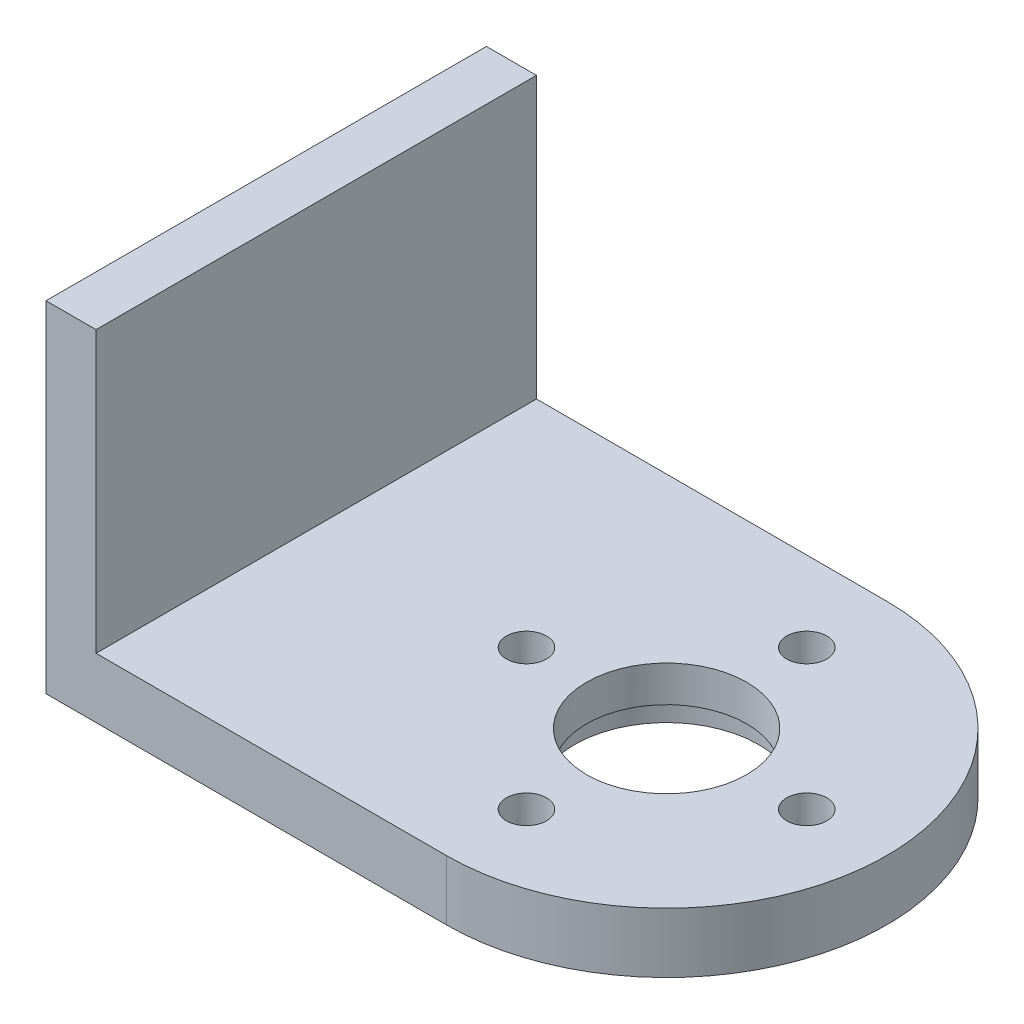
ISO-10303-21;
HEADER;
FILE_DESCRIPTION(('STEP AP214'),'2;1');
FILE_NAME('part.step','',(''),(''),'','','');
FILE_SCHEMA(('AUTOMOTIVE_DESIGN { 1 0 10303 214 1 1 1 1 }'));
ENDSEC;
DATA;
#1=APPLICATION_CONTEXT('core data for automotive mechanical design processes');
#2=APPLICATION_PROTOCOL_DEFINITION('international standard','automotive_design',2000,#1);
#3=PRODUCT_CONTEXT('',#1,'mechanical');
#4=PRODUCT('Part','Part','',(#3));
#5=PRODUCT_RELATED_PRODUCT_CATEGORY('part','',(#4));
#6=PRODUCT_DEFINITION_FORMATION('','',#4);
#7=PRODUCT_DEFINITION_CONTEXT('part definition',#1,'design');
#8=PRODUCT_DEFINITION('design','',#6,#7);
#9=PRODUCT_DEFINITION_SHAPE('','',#8);
#10=(LENGTH_UNIT() NAMED_UNIT(*) SI_UNIT(.MILLI.,.METRE.));
#11=(NAMED_UNIT(*) PLANE_ANGLE_UNIT() SI_UNIT($,.RADIAN.));
#12=(NAMED_UNIT(*) SI_UNIT($,.STERADIAN.) SOLID_ANGLE_UNIT());
#13=UNCERTAINTY_MEASURE_WITH_UNIT(LENGTH_MEASURE(1.E-05),#10,'distance_accuracy_value','');
#14=(GEOMETRIC_REPRESENTATION_CONTEXT(3) GLOBAL_UNCERTAINTY_ASSIGNED_CONTEXT((#13)) GLOBAL_UNIT_ASSIGNED_CONTEXT((#10,
#11,#12)) REPRESENTATION_CONTEXT('',''));
#15=CARTESIAN_POINT('',(0.,0.,0.));
#16=DIRECTION('',(0.,0.,1.));
#17=DIRECTION('',(1.,0.,0.));
#18=AXIS2_PLACEMENT_3D('',#15,#16,#17);
#19=CARTESIAN_POINT('',(5.99999999999998,3.,7.));
#20=DIRECTION('',(0.,-1.,0.));
#21=DIRECTION('',(0.,0.,-1.));
#22=AXIS2_PLACEMENT_3D('',#19,#20,#21);
#23=CYLINDRICAL_SURFACE('',#22,1.);
#24=CARTESIAN_POINT('',(5.99999999999998,3.,7.));
#25=DIRECTION('',(0.,1.,0.));
#26=DIRECTION('',(0.,0.,1.));
#27=AXIS2_PLACEMENT_3D('',#24,#25,#26);
#28=CIRCLE('',#27,1.);
#29=CARTESIAN_POINT('',(5.99999999999998,3.,8.));
#30=VERTEX_POINT('',#29);
#31=EDGE_CURVE('E175',#30,#30,#28,.T.);
#32=ORIENTED_EDGE('',*,*,#31,.T.);
#33=EDGE_LOOP('',(#32));
#34=FACE_BOUND('',#33,.T.);
#35=CARTESIAN_POINT('',(5.99999999999998,1.5,7.));
#36=DIRECTION('',(0.,-1.,0.));
#37=DIRECTION('',(0.,0.,-1.));
#38=AXIS2_PLACEMENT_3D('',#35,#36,#37);
#39=CIRCLE('',#38,1.);
#40=CARTESIAN_POINT('',(5.99999999999998,1.5,6.));
#41=VERTEX_POINT('',#40);
#42=EDGE_CURVE('E42',#41,#41,#39,.T.);
#43=ORIENTED_EDGE('',*,*,#42,.T.);
#44=EDGE_LOOP('',(#43));
#45=FACE_BOUND('',#44,.T.);
#46=ADVANCED_FACE('F38',(#34,#45),#23,.F.);
#47=CARTESIAN_POINT('',(-1.,3.,0.));
#48=DIRECTION('',(0.,-1.,0.));
#49=DIRECTION('',(0.,0.,-1.));
#50=AXIS2_PLACEMENT_3D('',#47,#48,#49);
#51=CYLINDRICAL_SURFACE('',#50,1.);
#52=CARTESIAN_POINT('',(-1.,3.,0.));
#53=DIRECTION('',(0.,1.,0.));
#54=DIRECTION('',(0.,0.,1.));
#55=AXIS2_PLACEMENT_3D('',#52,#53,#54);
#56=CIRCLE('',#55,1.);
#57=CARTESIAN_POINT('',(-1.,3.,0.999999999999951));
#58=VERTEX_POINT('',#57);
#59=EDGE_CURVE('E172',#58,#58,#56,.T.);
#60=ORIENTED_EDGE('',*,*,#59,.T.);
#61=EDGE_LOOP('',(#60));
#62=FACE_BOUND('',#61,.T.);
#63=CARTESIAN_POINT('',(-1.,1.5,0.));
#64=DIRECTION('',(0.,-1.,0.));
#65=DIRECTION('',(0.,0.,-1.));
#66=AXIS2_PLACEMENT_3D('',#63,#64,#65);
#67=CIRCLE('',#66,1.);
#68=CARTESIAN_POINT('',(-1.,1.5,-1.00000000000005));
#69=VERTEX_POINT('',#68);
#70=EDGE_CURVE('E132',#69,#69,#67,.T.);
#71=ORIENTED_EDGE('',*,*,#70,.T.);
#72=EDGE_LOOP('',(#71));
#73=FACE_BOUND('',#72,.T.);
#74=ADVANCED_FACE('F208',(#62,#73),#51,.F.);
#75=CARTESIAN_POINT('',(6.00000000000008,3.,-7.));
#76=DIRECTION('',(0.,-1.,0.));
#77=DIRECTION('',(0.,0.,-1.));
#78=AXIS2_PLACEMENT_3D('',#75,#76,#77);
#79=CYLINDRICAL_SURFACE('',#78,1.);
#80=CARTESIAN_POINT('',(6.00000000000008,3.,-7.));
#81=DIRECTION('',(0.,1.,0.));
#82=DIRECTION('',(0.,0.,1.));
#83=AXIS2_PLACEMENT_3D('',#80,#81,#82);
#84=CIRCLE('',#83,1.);
#85=CARTESIAN_POINT('',(6.00000000000008,3.,-6.));
#86=VERTEX_POINT('',#85);
#87=EDGE_CURVE('E169',#86,#86,#84,.T.);
#88=ORIENTED_EDGE('',*,*,#87,.T.);
#89=EDGE_LOOP('',(#88));
#90=FACE_BOUND('',#89,.T.);
#91=CARTESIAN_POINT('',(6.00000000000008,1.5,-7.));
#92=DIRECTION('',(0.,-1.,0.));
#93=DIRECTION('',(0.,0.,-1.));
#94=AXIS2_PLACEMENT_3D('',#91,#92,#93);
#95=CIRCLE('',#94,1.);
#96=CARTESIAN_POINT('',(6.00000000000008,1.5,-8.));
#97=VERTEX_POINT('',#96);
#98=EDGE_CURVE('E130',#97,#97,#95,.T.);
#99=ORIENTED_EDGE('',*,*,#98,.T.);
#100=EDGE_LOOP('',(#99));
#101=FACE_BOUND('',#100,.T.);
#102=ADVANCED_FACE('F214',(#90,#101),#79,.F.);
#103=CARTESIAN_POINT('',(13.,3.,0.));
#104=DIRECTION('',(0.,-1.,0.));
#105=DIRECTION('',(0.,0.,-1.));
#106=AXIS2_PLACEMENT_3D('',#103,#104,#105);
#107=CYLINDRICAL_SURFACE('',#106,1.);
#108=CARTESIAN_POINT('',(13.,3.,0.));
#109=DIRECTION('',(0.,1.,0.));
#110=DIRECTION('',(0.,0.,1.));
#111=AXIS2_PLACEMENT_3D('',#108,#109,#110);
#112=CIRCLE('',#111,1.);
#113=CARTESIAN_POINT('',(13.,3.,1.));
#114=VERTEX_POINT('',#113);
#115=EDGE_CURVE('E108',#114,#114,#112,.T.);
#116=ORIENTED_EDGE('',*,*,#115,.T.);
#117=EDGE_LOOP('',(#116));
#118=FACE_BOUND('',#117,.T.);
#119=CARTESIAN_POINT('',(13.,1.5,0.));
#120=DIRECTION('',(0.,-1.,0.));
#121=DIRECTION('',(0.,0.,-1.));
#122=AXIS2_PLACEMENT_3D('',#119,#120,#121);
#123=CIRCLE('',#122,1.);
#124=CARTESIAN_POINT('',(13.,1.5,-1.));
#125=VERTEX_POINT('',#124);
#126=EDGE_CURVE('E125',#125,#125,#123,.T.);
#127=ORIENTED_EDGE('',*,*,#126,.T.);
#128=EDGE_LOOP('',(#127));
#129=FACE_BOUND('',#128,.T.);
#130=ADVANCED_FACE('F222',(#118,#129),#107,.F.);
#131=CARTESIAN_POINT('',(6.,3.,0.));
#132=DIRECTION('',(0.,-1.,0.));
#133=DIRECTION('',(0.,0.,-1.));
#134=AXIS2_PLACEMENT_3D('',#131,#132,#133);
#135=CYLINDRICAL_SURFACE('',#134,4.);
#136=CARTESIAN_POINT('',(6.,3.,0.));
#137=DIRECTION('',(0.,1.,0.));
#138=DIRECTION('',(0.,0.,1.));
#139=AXIS2_PLACEMENT_3D('',#136,#137,#138);
#140=CIRCLE('',#139,4.);
#141=CARTESIAN_POINT('',(6.,3.,4.));
#142=VERTEX_POINT('',#141);
#143=EDGE_CURVE('E112',#142,#142,#140,.T.);
#144=ORIENTED_EDGE('',*,*,#143,.T.);
#145=EDGE_LOOP('',(#144));
#146=FACE_BOUND('',#145,.T.);
#147=CARTESIAN_POINT('',(6.,1.2,0.));
#148=DIRECTION('',(0.,-1.,0.));
#149=DIRECTION('',(0.,0.,-1.));
#150=AXIS2_PLACEMENT_3D('',#147,#148,#149);
#151=CIRCLE('',#150,4.);
#152=CARTESIAN_POINT('',(6.,1.2,-4.));
#153=VERTEX_POINT('',#152);
#154=EDGE_CURVE('E121',#153,#153,#151,.T.);
#155=ORIENTED_EDGE('',*,*,#154,.T.);
#156=EDGE_LOOP('',(#155));
#157=FACE_BOUND('',#156,.T.);
#158=ADVANCED_FACE('F219',(#146,#157),#135,.F.);
#159=CARTESIAN_POINT('',(6.,3.,0.));
#160=DIRECTION('',(0.,1.,0.));
#161=DIRECTION('',(0.,0.,1.));
#162=AXIS2_PLACEMENT_3D('',#159,#160,#161);
#163=PLANE('',#162);
#164=DIRECTION('',(0.,0.,-1.));
#165=VECTOR('',#164,1.);
#166=CARTESIAN_POINT('',(-11.5,3.,-11.));
#167=LINE('',#166,#165);
#168=CARTESIAN_POINT('',(-11.5,3.,11.));
#169=VERTEX_POINT('',#168);
#170=CARTESIAN_POINT('',(-11.5,3.,-11.));
#171=VERTEX_POINT('',#170);
#172=EDGE_CURVE('E55',#169,#171,#167,.T.);
#173=ORIENTED_EDGE('',*,*,#172,.F.);
#174=DIRECTION('',(1.,0.,0.));
#175=VECTOR('',#174,1.);
#176=CARTESIAN_POINT('',(6.,3.,11.));
#177=LINE('',#176,#175);
#178=CARTESIAN_POINT('',(6.,3.,11.));
#179=VERTEX_POINT('',#178);
#180=EDGE_CURVE('E93',#169,#179,#177,.T.);
#181=ORIENTED_EDGE('',*,*,#180,.T.);
#182=CARTESIAN_POINT('',(6.,3.,0.));
#183=DIRECTION('',(0.,1.,0.));
#184=DIRECTION('',(0.,0.,1.));
#185=AXIS2_PLACEMENT_3D('',#182,#183,#184);
#186=CIRCLE('',#185,11.);
#187=CARTESIAN_POINT('',(6.,3.,-11.));
#188=VERTEX_POINT('',#187);
#189=EDGE_CURVE('E61',#179,#188,#186,.T.);
#190=ORIENTED_EDGE('',*,*,#189,.T.);
#191=DIRECTION('',(-1.,0.,0.));
#192=VECTOR('',#191,1.);
#193=CARTESIAN_POINT('',(-14.,3.,-11.));
#194=LINE('',#193,#192);
#195=EDGE_CURVE('E104',#188,#171,#194,.T.);
#196=ORIENTED_EDGE('',*,*,#195,.T.);
#197=EDGE_LOOP('',(#173,#181,#190,#196));
#198=FACE_BOUND('',#197,.T.);
#199=ORIENTED_EDGE('',*,*,#59,.F.);
#200=EDGE_LOOP('',(#199));
#201=FACE_BOUND('',#200,.T.);
#202=ORIENTED_EDGE('',*,*,#143,.F.);
#203=EDGE_LOOP('',(#202));
#204=FACE_BOUND('',#203,.T.);
#205=ORIENTED_EDGE('',*,*,#115,.F.);
#206=EDGE_LOOP('',(#205));
#207=FACE_BOUND('',#206,.T.);
#208=ORIENTED_EDGE('',*,*,#31,.F.);
#209=EDGE_LOOP('',(#208));
#210=FACE_BOUND('',#209,.T.);
#211=ORIENTED_EDGE('',*,*,#87,.F.);
#212=EDGE_LOOP('',(#211));
#213=FACE_BOUND('',#212,.T.);
#214=ADVANCED_FACE('F182',(#198,#201,#204,#207,#210,#213),#163,.T.);
#215=CARTESIAN_POINT('',(6.,0.,0.));
#216=DIRECTION('',(0.,1.,0.));
#217=DIRECTION('',(0.,0.,1.));
#218=AXIS2_PLACEMENT_3D('',#215,#216,#217);
#219=PLANE('',#218);
#220=CARTESIAN_POINT('',(5.99999999999415,0.,-6.99999999999538));
#221=DIRECTION('',(0.,-1.,0.));
#222=DIRECTION('',(0.,0.,-1.));
#223=AXIS2_PLACEMENT_3D('',#220,#221,#222);
#224=CIRCLE('',#223,1.9);
#225=CARTESIAN_POINT('',(5.99999999999415,0.,-8.89999999999538));
#226=VERTEX_POINT('',#225);
#227=EDGE_CURVE('E260',#226,#226,#224,.T.);
#228=ORIENTED_EDGE('',*,*,#227,.F.);
#229=EDGE_LOOP('',(#228));
#230=FACE_BOUND('',#229,.T.);
#231=CARTESIAN_POINT('',(-1.00000000000121,0.,1.04930458969917E-11));
#232=DIRECTION('',(0.,-1.,0.));
#233=DIRECTION('',(0.,0.,-1.));
#234=AXIS2_PLACEMENT_3D('',#231,#232,#233);
#235=CIRCLE('',#234,1.9);
#236=CARTESIAN_POINT('',(-1.00000000000121,0.,-1.89999999998951));
#237=VERTEX_POINT('',#236);
#238=EDGE_CURVE('E268',#237,#237,#235,.T.);
#239=ORIENTED_EDGE('',*,*,#238,.F.);
#240=EDGE_LOOP('',(#239));
#241=FACE_BOUND('',#240,.T.);
#242=CARTESIAN_POINT('',(6.00000000000469,0.,7.00000000000583));
#243=DIRECTION('',(0.,-1.,0.));
#244=DIRECTION('',(0.,0.,-1.));
#245=AXIS2_PLACEMENT_3D('',#242,#243,#244);
#246=CIRCLE('',#245,1.9);
#247=CARTESIAN_POINT('',(6.00000000000469,0.,5.10000000000583));
#248=VERTEX_POINT('',#247);
#249=EDGE_CURVE('E273',#248,#248,#246,.T.);
#250=ORIENTED_EDGE('',*,*,#249,.F.);
#251=EDGE_LOOP('',(#250));
#252=FACE_BOUND('',#251,.T.);
#253=CARTESIAN_POINT('',(13.,0.,0.));
#254=DIRECTION('',(0.,-1.,0.));
#255=DIRECTION('',(0.,0.,-1.));
#256=AXIS2_PLACEMENT_3D('',#253,#254,#255);
#257=CIRCLE('',#256,1.9);
#258=CARTESIAN_POINT('',(13.,0.,-1.9));
#259=VERTEX_POINT('',#258);
#260=EDGE_CURVE('E138',#259,#259,#257,.T.);
#261=ORIENTED_EDGE('',*,*,#260,.F.);
#262=EDGE_LOOP('',(#261));
#263=FACE_BOUND('',#262,.T.);
#264=CARTESIAN_POINT('',(5.99999999999939,0.,5.22208257912396E-12));
#265=DIRECTION('',(0.,-1.,0.));
#266=DIRECTION('',(0.,0.,-1.));
#267=AXIS2_PLACEMENT_3D('',#264,#265,#266);
#268=CIRCLE('',#267,4.60000000001315);
#269=CARTESIAN_POINT('',(5.99999999999939,0.,-4.60000000000793));
#270=VERTEX_POINT('',#269);
#271=EDGE_CURVE('E128',#270,#270,#268,.T.);
#272=ORIENTED_EDGE('',*,*,#271,.F.);
#273=EDGE_LOOP('',(#272));
#274=FACE_BOUND('',#273,.T.);
#275=DIRECTION('',(1.,0.,0.));
#276=VECTOR('',#275,1.);
#277=CARTESIAN_POINT('',(6.,0.,11.));
#278=LINE('',#277,#276);
#279=CARTESIAN_POINT('',(-14.,0.,11.));
#280=VERTEX_POINT('',#279);
#281=CARTESIAN_POINT('',(6.,0.,11.));
#282=VERTEX_POINT('',#281);
#283=EDGE_CURVE('E99',#280,#282,#278,.T.);
#284=ORIENTED_EDGE('',*,*,#283,.F.);
#285=DIRECTION('',(0.,0.,1.));
#286=VECTOR('',#285,1.);
#287=CARTESIAN_POINT('',(-14.,0.,11.));
#288=LINE('',#287,#286);
#289=CARTESIAN_POINT('',(-14.,0.,-11.));
#290=VERTEX_POINT('',#289);
#291=EDGE_CURVE('E81',#290,#280,#288,.T.);
#292=ORIENTED_EDGE('',*,*,#291,.F.);
#293=DIRECTION('',(-1.,0.,0.));
#294=VECTOR('',#293,1.);
#295=CARTESIAN_POINT('',(-14.,0.,-11.));
#296=LINE('',#295,#294);
#297=CARTESIAN_POINT('',(6.,0.,-11.));
#298=VERTEX_POINT('',#297);
#299=EDGE_CURVE('E94',#298,#290,#296,.T.);
#300=ORIENTED_EDGE('',*,*,#299,.F.);
#301=CARTESIAN_POINT('',(6.,0.,0.));
#302=DIRECTION('',(0.,1.,0.));
#303=DIRECTION('',(0.,0.,1.));
#304=AXIS2_PLACEMENT_3D('',#301,#302,#303);
#305=CIRCLE('',#304,11.);
#306=EDGE_CURVE('E107',#282,#298,#305,.T.);
#307=ORIENTED_EDGE('',*,*,#306,.F.);
#308=EDGE_LOOP('',(#284,#292,#300,#307));
#309=FACE_BOUND('',#308,.T.);
#310=ADVANCED_FACE('F106',(#230,#241,#252,#263,#274,#309),#219,.F.);
#311=CARTESIAN_POINT('',(6.,3.,11.));
#312=DIRECTION('',(0.,0.,-1.));
#313=DIRECTION('',(-1.,0.,0.));
#314=AXIS2_PLACEMENT_3D('',#311,#312,#313);
#315=PLANE('',#314);
#316=ORIENTED_EDGE('',*,*,#283,.T.);
#317=DIRECTION('',(0.,-1.,0.));
#318=VECTOR('',#317,1.);
#319=CARTESIAN_POINT('',(6.,3.,11.));
#320=LINE('',#319,#318);
#321=EDGE_CURVE('E11',#179,#282,#320,.T.);
#322=ORIENTED_EDGE('',*,*,#321,.F.);
#323=ORIENTED_EDGE('',*,*,#180,.F.);
#324=DIRECTION('',(0.,-1.,0.));
#325=VECTOR('',#324,1.);
#326=CARTESIAN_POINT('',(-11.5,17.,11.));
#327=LINE('',#326,#325);
#328=CARTESIAN_POINT('',(-11.5,17.,11.));
#329=VERTEX_POINT('',#328);
#330=EDGE_CURVE('E166',#329,#169,#327,.T.);
#331=ORIENTED_EDGE('',*,*,#330,.F.);
#332=DIRECTION('',(1.,0.,0.));
#333=VECTOR('',#332,1.);
#334=CARTESIAN_POINT('',(-11.5,17.,11.));
#335=LINE('',#334,#333);
#336=CARTESIAN_POINT('',(-14.,17.,11.));
#337=VERTEX_POINT('',#336);
#338=EDGE_CURVE('E102',#337,#329,#335,.T.);
#339=ORIENTED_EDGE('',*,*,#338,.F.);
#340=DIRECTION('',(0.,-1.,0.));
#341=VECTOR('',#340,1.);
#342=CARTESIAN_POINT('',(-14.,3.,11.));
#343=LINE('',#342,#341);
#344=EDGE_CURVE('E86',#337,#280,#343,.T.);
#345=ORIENTED_EDGE('',*,*,#344,.T.);
#346=EDGE_LOOP('',(#316,#322,#323,#331,#339,#345));
#347=FACE_BOUND('',#346,.T.);
#348=ADVANCED_FACE('F40',(#347),#315,.F.);
#349=CARTESIAN_POINT('',(6.,3.,0.));
#350=DIRECTION('',(0.,-1.,0.));
#351=DIRECTION('',(0.,0.,-1.));
#352=AXIS2_PLACEMENT_3D('',#349,#350,#351);
#353=CYLINDRICAL_SURFACE('',#352,11.);
#354=ORIENTED_EDGE('',*,*,#306,.T.);
#355=DIRECTION('',(0.,-1.,0.));
#356=VECTOR('',#355,1.);
#357=CARTESIAN_POINT('',(6.,3.,-11.));
#358=LINE('',#357,#356);
#359=EDGE_CURVE('E47',#188,#298,#358,.T.);
#360=ORIENTED_EDGE('',*,*,#359,.F.);
#361=ORIENTED_EDGE('',*,*,#189,.F.);
#362=ORIENTED_EDGE('',*,*,#321,.T.);
#363=EDGE_LOOP('',(#354,#360,#361,#362));
#364=FACE_BOUND('',#363,.T.);
#365=ADVANCED_FACE('F200',(#364),#353,.T.);
#366=CARTESIAN_POINT('',(-14.,3.,-11.));
#367=DIRECTION('',(0.,0.,1.));
#368=DIRECTION('',(1.,0.,0.));
#369=AXIS2_PLACEMENT_3D('',#366,#367,#368);
#370=PLANE('',#369);
#371=ORIENTED_EDGE('',*,*,#299,.T.);
#372=DIRECTION('',(0.,-1.,0.));
#373=VECTOR('',#372,1.);
#374=CARTESIAN_POINT('',(-14.,3.,-11.));
#375=LINE('',#374,#373);
#376=CARTESIAN_POINT('',(-14.,17.,-11.));
#377=VERTEX_POINT('',#376);
#378=EDGE_CURVE('E89',#377,#290,#375,.T.);
#379=ORIENTED_EDGE('',*,*,#378,.F.);
#380=DIRECTION('',(-1.,0.,0.));
#381=VECTOR('',#380,1.);
#382=CARTESIAN_POINT('',(-14.,17.,-11.));
#383=LINE('',#382,#381);
#384=CARTESIAN_POINT('',(-11.5,17.,-11.));
#385=VERTEX_POINT('',#384);
#386=EDGE_CURVE('E159',#385,#377,#383,.T.);
#387=ORIENTED_EDGE('',*,*,#386,.F.);
#388=DIRECTION('',(0.,-1.,0.));
#389=VECTOR('',#388,1.);
#390=CARTESIAN_POINT('',(-11.5,17.,-11.));
#391=LINE('',#390,#389);
#392=EDGE_CURVE('E162',#385,#171,#391,.T.);
#393=ORIENTED_EDGE('',*,*,#392,.T.);
#394=ORIENTED_EDGE('',*,*,#195,.F.);
#395=ORIENTED_EDGE('',*,*,#359,.T.);
#396=EDGE_LOOP('',(#371,#379,#387,#393,#394,#395));
#397=FACE_BOUND('',#396,.T.);
#398=ADVANCED_FACE('F191',(#397),#370,.F.);
#399=CARTESIAN_POINT('',(-14.,3.,11.));
#400=DIRECTION('',(1.,0.,0.));
#401=DIRECTION('',(0.,0.,-1.));
#402=AXIS2_PLACEMENT_3D('',#399,#400,#401);
#403=PLANE('',#402);
#404=ORIENTED_EDGE('',*,*,#291,.T.);
#405=ORIENTED_EDGE('',*,*,#344,.F.);
#406=DIRECTION('',(0.,0.,1.));
#407=VECTOR('',#406,1.);
#408=CARTESIAN_POINT('',(-14.,17.,-11.));
#409=LINE('',#408,#407);
#410=EDGE_CURVE('E153',#377,#337,#409,.T.);
#411=ORIENTED_EDGE('',*,*,#410,.F.);
#412=ORIENTED_EDGE('',*,*,#378,.T.);
#413=EDGE_LOOP('',(#404,#405,#411,#412));
#414=FACE_BOUND('',#413,.T.);
#415=ADVANCED_FACE('F83',(#414),#403,.F.);
#416=CARTESIAN_POINT('',(-11.5,17.,-11.));
#417=DIRECTION('',(-1.,0.,0.));
#418=DIRECTION('',(0.,0.,1.));
#419=AXIS2_PLACEMENT_3D('',#416,#417,#418);
#420=PLANE('',#419);
#421=ORIENTED_EDGE('',*,*,#172,.T.);
#422=ORIENTED_EDGE('',*,*,#392,.F.);
#423=DIRECTION('',(0.,0.,-1.));
#424=VECTOR('',#423,1.);
#425=CARTESIAN_POINT('',(-11.5,17.,-11.));
#426=LINE('',#425,#424);
#427=EDGE_CURVE('E156',#329,#385,#426,.T.);
#428=ORIENTED_EDGE('',*,*,#427,.F.);
#429=ORIENTED_EDGE('',*,*,#330,.T.);
#430=EDGE_LOOP('',(#421,#422,#428,#429));
#431=FACE_BOUND('',#430,.T.);
#432=ADVANCED_FACE('F187',(#431),#420,.F.);
#433=CARTESIAN_POINT('',(0.,17.,0.));
#434=DIRECTION('',(0.,-1.,0.));
#435=DIRECTION('',(0.,0.,-1.));
#436=AXIS2_PLACEMENT_3D('',#433,#434,#435);
#437=PLANE('',#436);
#438=ORIENTED_EDGE('',*,*,#410,.T.);
#439=ORIENTED_EDGE('',*,*,#338,.T.);
#440=ORIENTED_EDGE('',*,*,#427,.T.);
#441=ORIENTED_EDGE('',*,*,#386,.T.);
#442=EDGE_LOOP('',(#438,#439,#440,#441));
#443=FACE_BOUND('',#442,.T.);
#444=ADVANCED_FACE('F195',(#443),#437,.F.);
#445=CARTESIAN_POINT('',(5.99999999999939,1.2,5.22208257912396E-12));
#446=DIRECTION('',(0.,-1.,0.));
#447=DIRECTION('',(0.,0.,-1.));
#448=AXIS2_PLACEMENT_3D('',#445,#446,#447);
#449=CYLINDRICAL_SURFACE('',#448,4.60000000001315);
#450=CARTESIAN_POINT('',(5.99999999999939,1.2,5.22208257912396E-12));
#451=DIRECTION('',(0.,-1.,0.));
#452=DIRECTION('',(0.,0.,-1.));
#453=AXIS2_PLACEMENT_3D('',#450,#451,#452);
#454=CIRCLE('',#453,4.60000000001315);
#455=CARTESIAN_POINT('',(5.99999999999939,1.2,-4.60000000000793));
#456=VERTEX_POINT('',#455);
#457=EDGE_CURVE('E124',#456,#456,#454,.T.);
#458=ORIENTED_EDGE('',*,*,#457,.F.);
#459=EDGE_LOOP('',(#458));
#460=FACE_BOUND('',#459,.T.);
#461=ORIENTED_EDGE('',*,*,#271,.T.);
#462=EDGE_LOOP('',(#461));
#463=FACE_BOUND('',#462,.T.);
#464=ADVANCED_FACE('F240',(#460,#463),#449,.F.);
#465=CARTESIAN_POINT('',(5.99999999999939,1.2,5.22208257912396E-12));
#466=DIRECTION('',(0.,-1.,0.));
#467=DIRECTION('',(0.,0.,-1.));
#468=AXIS2_PLACEMENT_3D('',#465,#466,#467);
#469=PLANE('',#468);
#470=ORIENTED_EDGE('',*,*,#154,.F.);
#471=EDGE_LOOP('',(#470));
#472=FACE_BOUND('',#471,.T.);
#473=ORIENTED_EDGE('',*,*,#457,.T.);
#474=EDGE_LOOP('',(#473));
#475=FACE_BOUND('',#474,.T.);
#476=ADVANCED_FACE('F284',(#472,#475),#469,.T.);
#477=CARTESIAN_POINT('',(13.,1.5,0.));
#478=DIRECTION('',(0.,-1.,0.));
#479=DIRECTION('',(0.,0.,-1.));
#480=AXIS2_PLACEMENT_3D('',#477,#478,#479);
#481=CYLINDRICAL_SURFACE('',#480,1.9);
#482=CARTESIAN_POINT('',(13.,1.5,0.));
#483=DIRECTION('',(0.,-1.,0.));
#484=DIRECTION('',(0.,0.,-1.));
#485=AXIS2_PLACEMENT_3D('',#482,#483,#484);
#486=CIRCLE('',#485,1.9);
#487=CARTESIAN_POINT('',(13.,1.5,-1.9));
#488=VERTEX_POINT('',#487);
#489=EDGE_CURVE('E129',#488,#488,#486,.T.);
#490=ORIENTED_EDGE('',*,*,#489,.F.);
#491=EDGE_LOOP('',(#490));
#492=FACE_BOUND('',#491,.T.);
#493=ORIENTED_EDGE('',*,*,#260,.T.);
#494=EDGE_LOOP('',(#493));
#495=FACE_BOUND('',#494,.T.);
#496=ADVANCED_FACE('F289',(#492,#495),#481,.F.);
#497=CARTESIAN_POINT('',(13.,1.5,0.));
#498=DIRECTION('',(0.,-1.,0.));
#499=DIRECTION('',(0.,0.,-1.));
#500=AXIS2_PLACEMENT_3D('',#497,#498,#499);
#501=PLANE('',#500);
#502=ORIENTED_EDGE('',*,*,#126,.F.);
#503=EDGE_LOOP('',(#502));
#504=FACE_BOUND('',#503,.T.);
#505=ORIENTED_EDGE('',*,*,#489,.T.);
#506=EDGE_LOOP('',(#505));
#507=FACE_BOUND('',#506,.T.);
#508=ADVANCED_FACE('F296',(#504,#507),#501,.T.);
#509=CARTESIAN_POINT('',(5.99999999999415,1.5,-6.99999999999538));
#510=DIRECTION('',(0.,-1.,0.));
#511=DIRECTION('',(0.,0.,-1.));
#512=AXIS2_PLACEMENT_3D('',#509,#510,#511);
#513=CYLINDRICAL_SURFACE('',#512,1.9);
#514=CARTESIAN_POINT('',(5.99999999999415,1.5,-6.99999999999538));
#515=DIRECTION('',(0.,-1.,0.));
#516=DIRECTION('',(0.,0.,-1.));
#517=AXIS2_PLACEMENT_3D('',#514,#515,#516);
#518=CIRCLE('',#517,1.9);
#519=CARTESIAN_POINT('',(5.99999999999415,1.5,-8.89999999999538));
#520=VERTEX_POINT('',#519);
#521=EDGE_CURVE('E133',#520,#520,#518,.T.);
#522=ORIENTED_EDGE('',*,*,#521,.F.);
#523=EDGE_LOOP('',(#522));
#524=FACE_BOUND('',#523,.T.);
#525=ORIENTED_EDGE('',*,*,#227,.T.);
#526=EDGE_LOOP('',(#525));
#527=FACE_BOUND('',#526,.T.);
#528=ADVANCED_FACE('F255',(#524,#527),#513,.F.);
#529=CARTESIAN_POINT('',(5.99999999999415,1.5,-6.99999999999538));
#530=DIRECTION('',(0.,-1.,0.));
#531=DIRECTION('',(0.,0.,-1.));
#532=AXIS2_PLACEMENT_3D('',#529,#530,#531);
#533=PLANE('',#532);
#534=ORIENTED_EDGE('',*,*,#98,.F.);
#535=EDGE_LOOP('',(#534));
#536=FACE_BOUND('',#535,.T.);
#537=ORIENTED_EDGE('',*,*,#521,.T.);
#538=EDGE_LOOP('',(#537));
#539=FACE_BOUND('',#538,.T.);
#540=ADVANCED_FACE('F251',(#536,#539),#533,.T.);
#541=CARTESIAN_POINT('',(-1.00000000000121,1.5,1.04930458969917E-11));
#542=DIRECTION('',(0.,-1.,0.));
#543=DIRECTION('',(0.,0.,-1.));
#544=AXIS2_PLACEMENT_3D('',#541,#542,#543);
#545=CYLINDRICAL_SURFACE('',#544,1.9);
#546=CARTESIAN_POINT('',(-1.00000000000121,1.5,1.04930458969917E-11));
#547=DIRECTION('',(0.,-1.,0.));
#548=DIRECTION('',(0.,0.,-1.));
#549=AXIS2_PLACEMENT_3D('',#546,#547,#548);
#550=CIRCLE('',#549,1.9);
#551=CARTESIAN_POINT('',(-1.00000000000121,1.5,-1.89999999998951));
#552=VERTEX_POINT('',#551);
#553=EDGE_CURVE('E263',#552,#552,#550,.T.);
#554=ORIENTED_EDGE('',*,*,#553,.F.);
#555=EDGE_LOOP('',(#554));
#556=FACE_BOUND('',#555,.T.);
#557=ORIENTED_EDGE('',*,*,#238,.T.);
#558=EDGE_LOOP('',(#557));
#559=FACE_BOUND('',#558,.T.);
#560=ADVANCED_FACE('F254',(#556,#559),#545,.F.);
#561=CARTESIAN_POINT('',(-1.00000000000121,1.5,1.04930458969917E-11));
#562=DIRECTION('',(0.,-1.,0.));
#563=DIRECTION('',(0.,0.,-1.));
#564=AXIS2_PLACEMENT_3D('',#561,#562,#563);
#565=PLANE('',#564);
#566=ORIENTED_EDGE('',*,*,#70,.F.);
#567=EDGE_LOOP('',(#566));
#568=FACE_BOUND('',#567,.T.);
#569=ORIENTED_EDGE('',*,*,#553,.T.);
#570=EDGE_LOOP('',(#569));
#571=FACE_BOUND('',#570,.T.);
#572=ADVANCED_FACE('F304',(#568,#571),#565,.T.);
#573=CARTESIAN_POINT('',(6.00000000000469,1.5,7.00000000000583));
#574=DIRECTION('',(0.,-1.,0.));
#575=DIRECTION('',(0.,0.,-1.));
#576=AXIS2_PLACEMENT_3D('',#573,#574,#575);
#577=CYLINDRICAL_SURFACE('',#576,1.9);
#578=CARTESIAN_POINT('',(6.00000000000469,1.5,7.00000000000583));
#579=DIRECTION('',(0.,-1.,0.));
#580=DIRECTION('',(0.,0.,-1.));
#581=AXIS2_PLACEMENT_3D('',#578,#579,#580);
#582=CIRCLE('',#581,1.9);
#583=CARTESIAN_POINT('',(6.00000000000469,1.5,5.10000000000583));
#584=VERTEX_POINT('',#583);
#585=EDGE_CURVE('E271',#584,#584,#582,.T.);
#586=ORIENTED_EDGE('',*,*,#585,.F.);
#587=EDGE_LOOP('',(#586));
#588=FACE_BOUND('',#587,.T.);
#589=ORIENTED_EDGE('',*,*,#249,.T.);
#590=EDGE_LOOP('',(#589));
#591=FACE_BOUND('',#590,.T.);
#592=ADVANCED_FACE('F277',(#588,#591),#577,.F.);
#593=CARTESIAN_POINT('',(6.00000000000469,1.5,7.00000000000583));
#594=DIRECTION('',(0.,-1.,0.));
#595=DIRECTION('',(0.,0.,-1.));
#596=AXIS2_PLACEMENT_3D('',#593,#594,#595);
#597=PLANE('',#596);
#598=ORIENTED_EDGE('',*,*,#42,.F.);
#599=EDGE_LOOP('',(#598));
#600=FACE_BOUND('',#599,.T.);
#601=ORIENTED_EDGE('',*,*,#585,.T.);
#602=EDGE_LOOP('',(#601));
#603=FACE_BOUND('',#602,.T.);
#604=ADVANCED_FACE('F303',(#600,#603),#597,.T.);
#605=CLOSED_SHELL('',(#46,#74,#102,#130,#158,#214,#310,#348,#365,#398,#415,#432,#444,#464,#476,
#496,#508,#528,#540,#560,#572,#592,#604));
#606=MANIFOLD_SOLID_BREP('B2',#605);
#607=ADVANCED_BREP_SHAPE_REPRESENTATION('',(#18,#606),#14);
#608=SHAPE_DEFINITION_REPRESENTATION(#9,#607);
ENDSEC;
END-ISO-10303-21;
